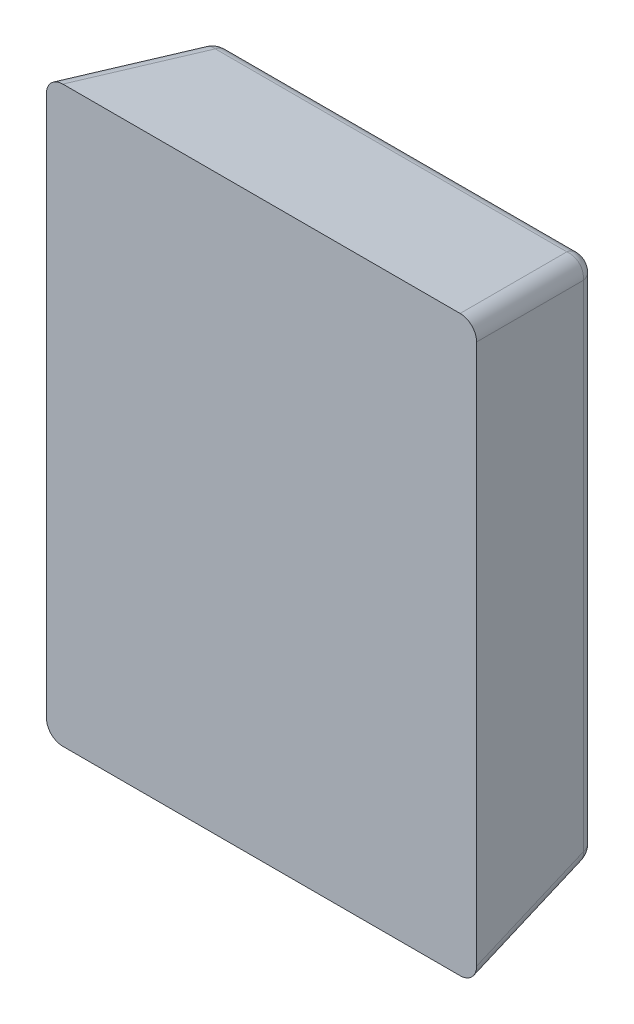
ISO-10303-21;
HEADER;
FILE_DESCRIPTION(('STEP AP214'),'2;1');
FILE_NAME('part.step','',(''),(''),'','','');
FILE_SCHEMA(('AUTOMOTIVE_DESIGN { 1 0 10303 214 1 1 1 1 }'));
ENDSEC;
DATA;
#1=APPLICATION_CONTEXT('core data for automotive mechanical design processes');
#2=APPLICATION_PROTOCOL_DEFINITION('international standard','automotive_design',2000,#1);
#3=PRODUCT_CONTEXT('',#1,'mechanical');
#4=PRODUCT('Part','Part','',(#3));
#5=PRODUCT_RELATED_PRODUCT_CATEGORY('part','',(#4));
#6=PRODUCT_DEFINITION_FORMATION('','',#4);
#7=PRODUCT_DEFINITION_CONTEXT('part definition',#1,'design');
#8=PRODUCT_DEFINITION('design','',#6,#7);
#9=PRODUCT_DEFINITION_SHAPE('','',#8);
#10=(LENGTH_UNIT() NAMED_UNIT(*) SI_UNIT(.MILLI.,.METRE.));
#11=(NAMED_UNIT(*) PLANE_ANGLE_UNIT() SI_UNIT($,.RADIAN.));
#12=(NAMED_UNIT(*) SI_UNIT($,.STERADIAN.) SOLID_ANGLE_UNIT());
#13=UNCERTAINTY_MEASURE_WITH_UNIT(LENGTH_MEASURE(1.E-05),#10,'distance_accuracy_value','');
#14=(GEOMETRIC_REPRESENTATION_CONTEXT(3) GLOBAL_UNCERTAINTY_ASSIGNED_CONTEXT((#13)) GLOBAL_UNIT_ASSIGNED_CONTEXT((#10,
#11,#12)) REPRESENTATION_CONTEXT('',''));
#15=CARTESIAN_POINT('',(0.,0.,0.));
#16=DIRECTION('',(0.,0.,1.));
#17=DIRECTION('',(1.,0.,0.));
#18=AXIS2_PLACEMENT_3D('',#15,#16,#17);
#19=CARTESIAN_POINT('',(-0.927464285309384,-0.641019643054923,0.105));
#20=DIRECTION('',(0.,0.,-1.));
#21=DIRECTION('',(-1.,0.,0.));
#22=AXIS2_PLACEMENT_3D('',#19,#20,#21);
#23=PLANE('',#22);
#24=DIRECTION('',(0.,-1.,0.));
#25=VECTOR('',#24,1.);
#26=CARTESIAN_POINT('',(-0.853917601570132,-0.701017157850477,0.105));
#27=LINE('',#26,#25);
#28=CARTESIAN_POINT('',(-0.853917601570131,-0.744561356385283,0.105));
#29=VERTEX_POINT('',#28);
#30=CARTESIAN_POINT('',(-0.853917601570132,-0.537477929724562,0.105));
#31=VERTEX_POINT('',#30);
#32=EDGE_CURVE('E236',#29,#31,#27,.F.);
#33=ORIENTED_EDGE('',*,*,#32,.F.);
#34=DIRECTION('',(-1.,0.,0.));
#35=VECTOR('',#34,1.);
#36=CARTESIAN_POINT('',(-0.972464285309384,-0.744561356385283,0.105));
#37=LINE('',#36,#35);
#38=CARTESIAN_POINT('',(-1.00101096904863,-0.744561356385283,0.105));
#39=VERTEX_POINT('',#38);
#40=EDGE_CURVE('E224',#39,#29,#37,.F.);
#41=ORIENTED_EDGE('',*,*,#40,.F.);
#42=DIRECTION('',(0.,1.,0.));
#43=VECTOR('',#42,1.);
#44=CARTESIAN_POINT('',(-1.00101096904864,-0.581022128259368,0.105));
#45=LINE('',#44,#43);
#46=CARTESIAN_POINT('',(-1.00101096904864,-0.537477929724562,0.105));
#47=VERTEX_POINT('',#46);
#48=EDGE_CURVE('E229',#47,#39,#45,.F.);
#49=ORIENTED_EDGE('',*,*,#48,.F.);
#50=DIRECTION('',(1.,0.,0.));
#51=VECTOR('',#50,1.);
#52=CARTESIAN_POINT('',(-0.882464285309384,-0.537477929724562,0.105));
#53=LINE('',#52,#51);
#54=EDGE_CURVE('E241',#31,#47,#53,.F.);
#55=ORIENTED_EDGE('',*,*,#54,.F.);
#56=EDGE_LOOP('',(#33,#41,#49,#55));
#57=FACE_BOUND('',#56,.T.);
#58=ADVANCED_FACE('F17',(#57),#23,.T.);
#59=CARTESIAN_POINT('',(-1.00101096904864,-0.581022128259368,0.112));
#60=DIRECTION('',(0.,1.,0.));
#61=DIRECTION('',(-1.,0.,0.));
#62=AXIS2_PLACEMENT_3D('',#59,#60,#61);
#63=CYLINDRICAL_SURFACE('',#62,0.007);
#64=DIRECTION('',(0.,1.,0.));
#65=VECTOR('',#64,1.);
#66=CARTESIAN_POINT('',(-1.00790462331972,-0.521024613463813,0.110784462756332));
#67=LINE('',#66,#65);
#68=CARTESIAN_POINT('',(-1.00790462331972,-0.537477929724562,0.110784462756332));
#69=VERTEX_POINT('',#68);
#70=CARTESIAN_POINT('',(-1.00790462331972,-0.744561356385283,0.110784462756331));
#71=VERTEX_POINT('',#70);
#72=EDGE_CURVE('E114',#69,#71,#67,.F.);
#73=ORIENTED_EDGE('',*,*,#72,.F.);
#74=CARTESIAN_POINT('',(-1.00101096904863,-0.537477929724562,0.112));
#75=DIRECTION('',(0.,1.,0.));
#76=DIRECTION('',(1.,0.,0.));
#77=AXIS2_PLACEMENT_3D('',#74,#75,#76);
#78=CIRCLE('',#77,0.007);
#79=EDGE_CURVE('E221',#47,#69,#78,.T.);
#80=ORIENTED_EDGE('',*,*,#79,.F.);
#81=ORIENTED_EDGE('',*,*,#48,.T.);
#82=CARTESIAN_POINT('',(-1.00101096904863,-0.744561356385283,0.112));
#83=DIRECTION('',(0.,1.,0.));
#84=DIRECTION('',(1.,0.,0.));
#85=AXIS2_PLACEMENT_3D('',#82,#83,#84);
#86=CIRCLE('',#85,0.007);
#87=EDGE_CURVE('E74',#71,#39,#86,.F.);
#88=ORIENTED_EDGE('',*,*,#87,.F.);
#89=EDGE_LOOP('',(#73,#80,#81,#88));
#90=FACE_BOUND('',#89,.T.);
#91=ADVANCED_FACE('F214',(#90),#63,.T.);
#92=CARTESIAN_POINT('',(-1.00101096904863,-0.537477929724562,0.112));
#93=DIRECTION('',(1.,0.,0.));
#94=DIRECTION('',(0.,1.,0.));
#95=AXIS2_PLACEMENT_3D('',#92,#93,#94);
#96=SPHERICAL_SURFACE('',#95,0.007);
#97=ORIENTED_EDGE('',*,*,#79,.T.);
#98=CARTESIAN_POINT('',(-1.00101096904863,-0.537477929724562,0.111999999999999));
#99=DIRECTION('',(-0.17108786974604,0.171087869746041,0.970287525247812));
#100=DIRECTION('',(0.,-0.984807753012207,0.173648177666936));
#101=AXIS2_PLACEMENT_3D('',#98,#99,#100);
#102=CIRCLE('',#101,0.007);
#103=CARTESIAN_POINT('',(-1.00101096904864,-0.530584275453477,0.11078446275633));
#104=VERTEX_POINT('',#103);
#105=EDGE_CURVE('E20',#104,#69,#102,.T.);
#106=ORIENTED_EDGE('',*,*,#105,.F.);
#107=CARTESIAN_POINT('',(-1.00101096904864,-0.537477929724562,0.112));
#108=DIRECTION('',(1.,0.,0.));
#109=DIRECTION('',(0.,1.,0.));
#110=AXIS2_PLACEMENT_3D('',#107,#108,#109);
#111=CIRCLE('',#110,0.007);
#112=EDGE_CURVE('E223',#47,#104,#111,.T.);
#113=ORIENTED_EDGE('',*,*,#112,.F.);
#114=EDGE_LOOP('',(#97,#106,#113));
#115=FACE_BOUND('',#114,.T.);
#116=ADVANCED_FACE('F210',(#115),#96,.T.);
#117=CARTESIAN_POINT('',(-0.882464285309384,-0.537477929724562,0.112));
#118=DIRECTION('',(1.,0.,0.));
#119=DIRECTION('',(0.,1.,0.));
#120=AXIS2_PLACEMENT_3D('',#117,#118,#119);
#121=CYLINDRICAL_SURFACE('',#120,0.007);
#122=DIRECTION('',(1.,0.,0.));
#123=VECTOR('',#122,1.);
#124=CARTESIAN_POINT('',(-0.837464285309383,-0.530584275453476,0.110784462756331));
#125=LINE('',#124,#123);
#126=CARTESIAN_POINT('',(-0.853917601570132,-0.530584275453476,0.110784462756331));
#127=VERTEX_POINT('',#126);
#128=EDGE_CURVE('E146',#127,#104,#125,.F.);
#129=ORIENTED_EDGE('',*,*,#128,.F.);
#130=CARTESIAN_POINT('',(-0.853917601570132,-0.537477929724562,0.112));
#131=DIRECTION('',(1.,0.,0.));
#132=DIRECTION('',(0.,1.,0.));
#133=AXIS2_PLACEMENT_3D('',#130,#131,#132);
#134=CIRCLE('',#133,0.00699999999999995);
#135=EDGE_CURVE('E198',#31,#127,#134,.T.);
#136=ORIENTED_EDGE('',*,*,#135,.F.);
#137=ORIENTED_EDGE('',*,*,#54,.T.);
#138=ORIENTED_EDGE('',*,*,#112,.T.);
#139=EDGE_LOOP('',(#129,#136,#137,#138));
#140=FACE_BOUND('',#139,.T.);
#141=ADVANCED_FACE('F206',(#140),#121,.T.);
#142=CARTESIAN_POINT('',(-0.853917601570132,-0.537477929724562,0.112));
#143=DIRECTION('',(1.,0.,0.));
#144=DIRECTION('',(0.,1.,0.));
#145=AXIS2_PLACEMENT_3D('',#142,#143,#144);
#146=SPHERICAL_SURFACE('',#145,0.007);
#147=ORIENTED_EDGE('',*,*,#135,.T.);
#148=CARTESIAN_POINT('',(-0.853917601570132,-0.537477929724561,0.111999999999999));
#149=DIRECTION('',(0.171087869746028,0.171087869746031,0.970287525247816));
#150=DIRECTION('',(0.,-0.984807753012209,0.173648177666926));
#151=AXIS2_PLACEMENT_3D('',#148,#149,#150);
#152=CIRCLE('',#151,0.007);
#153=CARTESIAN_POINT('',(-0.847023947299047,-0.537477929724563,0.110784462756331));
#154=VERTEX_POINT('',#153);
#155=EDGE_CURVE('E136',#154,#127,#152,.T.);
#156=ORIENTED_EDGE('',*,*,#155,.F.);
#157=CARTESIAN_POINT('',(-0.853917601570132,-0.537477929724562,0.112));
#158=DIRECTION('',(0.,-1.,0.));
#159=DIRECTION('',(1.,0.,0.));
#160=AXIS2_PLACEMENT_3D('',#157,#158,#159);
#161=CIRCLE('',#160,0.007);
#162=EDGE_CURVE('E194',#31,#154,#161,.T.);
#163=ORIENTED_EDGE('',*,*,#162,.F.);
#164=EDGE_LOOP('',(#147,#156,#163));
#165=FACE_BOUND('',#164,.T.);
#166=ADVANCED_FACE('F203',(#165),#146,.T.);
#167=CARTESIAN_POINT('',(-0.853917601570132,-0.701017157850477,0.112));
#168=DIRECTION('',(0.,-1.,0.));
#169=DIRECTION('',(1.,0.,0.));
#170=AXIS2_PLACEMENT_3D('',#167,#168,#169);
#171=CYLINDRICAL_SURFACE('',#170,0.007);
#172=DIRECTION('',(0.,1.,0.));
#173=VECTOR('',#172,1.);
#174=CARTESIAN_POINT('',(-0.847023947299046,-0.761014672646032,0.110784462756331));
#175=LINE('',#174,#173);
#176=CARTESIAN_POINT('',(-0.847023947299046,-0.744561356385283,0.110784462756331));
#177=VERTEX_POINT('',#176);
#178=EDGE_CURVE('E137',#177,#154,#175,.T.);
#179=ORIENTED_EDGE('',*,*,#178,.F.);
#180=CARTESIAN_POINT('',(-0.853917601570131,-0.744561356385283,0.112));
#181=DIRECTION('',(0.,1.,0.));
#182=DIRECTION('',(1.,0.,0.));
#183=AXIS2_PLACEMENT_3D('',#180,#181,#182);
#184=CIRCLE('',#183,0.007);
#185=EDGE_CURVE('E190',#29,#177,#184,.F.);
#186=ORIENTED_EDGE('',*,*,#185,.F.);
#187=ORIENTED_EDGE('',*,*,#32,.T.);
#188=ORIENTED_EDGE('',*,*,#162,.T.);
#189=EDGE_LOOP('',(#179,#186,#187,#188));
#190=FACE_BOUND('',#189,.T.);
#191=ADVANCED_FACE('F182',(#190),#171,.T.);
#192=CARTESIAN_POINT('',(-0.853917601570131,-0.744561356385283,0.112));
#193=DIRECTION('',(1.,0.,0.));
#194=DIRECTION('',(0.,1.,0.));
#195=AXIS2_PLACEMENT_3D('',#192,#193,#194);
#196=SPHERICAL_SURFACE('',#195,0.007);
#197=CARTESIAN_POINT('',(-0.853917601570131,-0.744561356385283,0.112));
#198=DIRECTION('',(-1.,0.,0.));
#199=DIRECTION('',(0.,-1.,0.));
#200=AXIS2_PLACEMENT_3D('',#197,#198,#199);
#201=CIRCLE('',#200,0.007);
#202=CARTESIAN_POINT('',(-0.853917601570131,-0.751455010656368,0.110784462756331));
#203=VERTEX_POINT('',#202);
#204=EDGE_CURVE('E193',#29,#203,#201,.T.);
#205=ORIENTED_EDGE('',*,*,#204,.F.);
#206=ORIENTED_EDGE('',*,*,#185,.T.);
#207=CARTESIAN_POINT('',(-0.853917601570132,-0.744561356385283,0.112));
#208=DIRECTION('',(0.171087869746032,-0.171087869746034,0.970287525247815));
#209=DIRECTION('',(0.,-0.984807753012208,-0.173648177666929));
#210=AXIS2_PLACEMENT_3D('',#207,#208,#209);
#211=CIRCLE('',#210,0.007);
#212=EDGE_CURVE('E133',#203,#177,#211,.T.);
#213=ORIENTED_EDGE('',*,*,#212,.F.);
#214=EDGE_LOOP('',(#205,#206,#213));
#215=FACE_BOUND('',#214,.T.);
#216=ADVANCED_FACE('F178',(#215),#196,.T.);
#217=CARTESIAN_POINT('',(-0.972464285309384,-0.744561356385283,0.112));
#218=DIRECTION('',(-1.,0.,0.));
#219=DIRECTION('',(0.,-1.,0.));
#220=AXIS2_PLACEMENT_3D('',#217,#218,#219);
#221=CYLINDRICAL_SURFACE('',#220,0.007);
#222=DIRECTION('',(1.,0.,0.));
#223=VECTOR('',#222,1.);
#224=CARTESIAN_POINT('',(-1.01746428530938,-0.751455010656368,0.110784462756331));
#225=LINE('',#224,#223);
#226=CARTESIAN_POINT('',(-1.00101096904863,-0.751455010656369,0.110784462756331));
#227=VERTEX_POINT('',#226);
#228=EDGE_CURVE('E134',#227,#203,#225,.T.);
#229=ORIENTED_EDGE('',*,*,#228,.F.);
#230=CARTESIAN_POINT('',(-1.00101096904863,-0.744561356385283,0.112));
#231=DIRECTION('',(1.,0.,0.));
#232=DIRECTION('',(0.,1.,0.));
#233=AXIS2_PLACEMENT_3D('',#230,#231,#232);
#234=CIRCLE('',#233,0.00699999999999995);
#235=EDGE_CURVE('E82',#39,#227,#234,.F.);
#236=ORIENTED_EDGE('',*,*,#235,.F.);
#237=ORIENTED_EDGE('',*,*,#40,.T.);
#238=ORIENTED_EDGE('',*,*,#204,.T.);
#239=EDGE_LOOP('',(#229,#236,#237,#238));
#240=FACE_BOUND('',#239,.T.);
#241=ADVANCED_FACE('F173',(#240),#221,.T.);
#242=CARTESIAN_POINT('',(-1.00101096904863,-0.744561356385283,0.112));
#243=DIRECTION('',(1.,0.,0.));
#244=DIRECTION('',(0.,1.,0.));
#245=AXIS2_PLACEMENT_3D('',#242,#243,#244);
#246=SPHERICAL_SURFACE('',#245,0.007);
#247=ORIENTED_EDGE('',*,*,#87,.T.);
#248=ORIENTED_EDGE('',*,*,#235,.T.);
#249=CARTESIAN_POINT('',(-1.00101096904864,-0.744561356385283,0.111999999999999));
#250=DIRECTION('',(-0.171087869746039,-0.171087869746042,0.970287525247812));
#251=DIRECTION('',(0.,-0.984807753012207,-0.173648177666937));
#252=AXIS2_PLACEMENT_3D('',#249,#250,#251);
#253=CIRCLE('',#252,0.007);
#254=EDGE_CURVE('E126',#71,#227,#253,.T.);
#255=ORIENTED_EDGE('',*,*,#254,.F.);
#256=EDGE_LOOP('',(#247,#248,#255));
#257=FACE_BOUND('',#256,.T.);
#258=ADVANCED_FACE('F169',(#257),#246,.T.);
#259=CARTESIAN_POINT('',(-1.01746428530938,-0.521024613463813,0.165));
#260=DIRECTION('',(-0.984807753012208,0.,-0.173648177666929));
#261=DIRECTION('',(-0.173648177666929,0.,0.984807753012208));
#262=AXIS2_PLACEMENT_3D('',#259,#260,#261);
#263=PLANE('',#262);
#264=DIRECTION('',(-0.17108786974604,0.171087869746041,0.970287525247812));
#265=VECTOR('',#264,1.);
#266=CARTESIAN_POINT('',(-1.0150316745458,-0.530350878498484,0.15120397880227));
#267=LINE('',#266,#265);
#268=CARTESIAN_POINT('',(-1.01746428530938,-0.527918267734898,0.165));
#269=VERTEX_POINT('',#268);
#270=EDGE_CURVE('E104',#69,#269,#267,.T.);
#271=ORIENTED_EDGE('',*,*,#270,.F.);
#272=ORIENTED_EDGE('',*,*,#72,.T.);
#273=DIRECTION('',(-0.171087869746034,-0.171087869746047,0.970287525247812));
#274=VECTOR('',#273,1.);
#275=CARTESIAN_POINT('',(-1.00790462331972,-0.744561356385283,0.110784462756332));
#276=LINE('',#275,#274);
#277=CARTESIAN_POINT('',(-1.01746428530938,-0.754121018374947,0.165));
#278=VERTEX_POINT('',#277);
#279=EDGE_CURVE('E111',#71,#278,#276,.T.);
#280=ORIENTED_EDGE('',*,*,#279,.T.);
#281=DIRECTION('',(0.,1.,0.));
#282=VECTOR('',#281,1.);
#283=CARTESIAN_POINT('',(-1.01746428530938,-0.641019643054923,0.165));
#284=LINE('',#283,#282);
#285=EDGE_CURVE('E113',#278,#269,#284,.T.);
#286=ORIENTED_EDGE('',*,*,#285,.T.);
#287=EDGE_LOOP('',(#271,#272,#280,#286));
#288=FACE_BOUND('',#287,.T.);
#289=ADVANCED_FACE('F112',(#288),#263,.T.);
#290=CARTESIAN_POINT('',(-1.00813802027471,-0.530350878498484,0.152419516045939));
#291=DIRECTION('',(-0.17108786974604,0.171087869746041,0.970287525247812));
#292=DIRECTION('',(0.,-0.984807753012207,0.173648177666936));
#293=AXIS2_PLACEMENT_3D('',#290,#291,#292);
#294=CYLINDRICAL_SURFACE('',#293,0.007);
#295=DIRECTION('',(-0.171087869746149,0.171087869746032,0.970287525247794));
#296=VECTOR('',#295,1.);
#297=CARTESIAN_POINT('',(-1.00101096904863,-0.530584275453477,0.110784462756331));
#298=LINE('',#297,#296);
#299=CARTESIAN_POINT('',(-1.0105706310383,-0.521024613463813,0.165));
#300=VERTEX_POINT('',#299);
#301=EDGE_CURVE('E151',#104,#300,#298,.T.);
#302=ORIENTED_EDGE('',*,*,#301,.F.);
#303=ORIENTED_EDGE('',*,*,#105,.T.);
#304=ORIENTED_EDGE('',*,*,#270,.T.);
#305=CARTESIAN_POINT('',(-1.01035629902618,-0.528132599747013,0.165));
#306=DIRECTION('',(0.,0.,-1.));
#307=DIRECTION('',(-0.707106781186545,0.707106781186551,0.));
#308=AXIS2_PLACEMENT_3D('',#305,#306,#307);
#309=ELLIPSE('',#308,0.00721435638184897,0.007);
#310=EDGE_CURVE('E120',#269,#300,#309,.T.);
#311=ORIENTED_EDGE('',*,*,#310,.T.);
#312=EDGE_LOOP('',(#302,#303,#304,#311));
#313=FACE_BOUND('',#312,.T.);
#314=ADVANCED_FACE('F279',(#313),#294,.T.);
#315=CARTESIAN_POINT('',(-0.837464285309383,-0.521024613463813,0.165));
#316=DIRECTION('',(0.,0.984807753012208,-0.17364817766693));
#317=DIRECTION('',(0.,0.17364817766693,0.984807753012208));
#318=AXIS2_PLACEMENT_3D('',#315,#316,#317);
#319=PLANE('',#318);
#320=DIRECTION('',(0.171087869746028,0.171087869746031,0.970287525247816));
#321=VECTOR('',#320,1.);
#322=CARTESIAN_POINT('',(-0.847668536630149,-0.524335210513493,0.14622467114007));
#323=LINE('',#322,#321);
#324=CARTESIAN_POINT('',(-0.844357939580469,-0.521024613463813,0.165));
#325=VERTEX_POINT('',#324);
#326=EDGE_CURVE('E138',#127,#325,#323,.T.);
#327=ORIENTED_EDGE('',*,*,#326,.F.);
#328=ORIENTED_EDGE('',*,*,#128,.T.);
#329=ORIENTED_EDGE('',*,*,#301,.T.);
#330=DIRECTION('',(-1.,0.,0.));
#331=VECTOR('',#330,1.);
#332=CARTESIAN_POINT('',(-0.927464285309384,-0.521024613463813,0.165));
#333=LINE('',#332,#331);
#334=EDGE_CURVE('E156',#300,#325,#333,.F.);
#335=ORIENTED_EDGE('',*,*,#334,.T.);
#336=EDGE_LOOP('',(#327,#328,#329,#335));
#337=FACE_BOUND('',#336,.T.);
#338=ADVANCED_FACE('F271',(#337),#319,.T.);
#339=CARTESIAN_POINT('',(-0.847668536630149,-0.531228864784578,0.147440208383739));
#340=DIRECTION('',(0.171087869746028,0.171087869746031,0.970287525247816));
#341=DIRECTION('',(0.,-0.984807753012209,0.173648177666926));
#342=AXIS2_PLACEMENT_3D('',#339,#340,#341);
#343=CYLINDRICAL_SURFACE('',#342,0.007);
#344=DIRECTION('',(0.171087869746034,0.171087869746043,0.970287525247813));
#345=VECTOR('',#344,1.);
#346=CARTESIAN_POINT('',(-0.847023947299047,-0.537477929724562,0.110784462756331));
#347=LINE('',#346,#345);
#348=CARTESIAN_POINT('',(-0.837464285309384,-0.527918267734898,0.165));
#349=VERTEX_POINT('',#348);
#350=EDGE_CURVE('E144',#154,#349,#347,.T.);
#351=ORIENTED_EDGE('',*,*,#350,.F.);
#352=ORIENTED_EDGE('',*,*,#155,.T.);
#353=ORIENTED_EDGE('',*,*,#326,.T.);
#354=CARTESIAN_POINT('',(-0.844572271592584,-0.528132599747013,0.165));
#355=DIRECTION('',(0.,0.,-1.));
#356=DIRECTION('',(0.707106781186542,0.707106781186553,0.));
#357=AXIS2_PLACEMENT_3D('',#354,#355,#356);
#358=ELLIPSE('',#357,0.00721435638184894,0.007);
#359=EDGE_CURVE('E159',#325,#349,#358,.T.);
#360=ORIENTED_EDGE('',*,*,#359,.T.);
#361=EDGE_LOOP('',(#351,#352,#353,#360));
#362=FACE_BOUND('',#361,.T.);
#363=ADVANCED_FACE('F269',(#362),#343,.T.);
#364=CARTESIAN_POINT('',(-0.837464285309383,-0.761014672646032,0.165));
#365=DIRECTION('',(0.984807753012208,0.,-0.173648177666928));
#366=DIRECTION('',(-0.173648177666928,0.,-0.984807753012208));
#367=AXIS2_PLACEMENT_3D('',#364,#365,#366);
#368=PLANE('',#367);
#369=ORIENTED_EDGE('',*,*,#350,.T.);
#370=DIRECTION('',(0.,1.,0.));
#371=VECTOR('',#370,1.);
#372=CARTESIAN_POINT('',(-0.837464285309383,-0.641019643054923,0.165));
#373=LINE('',#372,#371);
#374=CARTESIAN_POINT('',(-0.837464285309383,-0.754121018374946,0.165));
#375=VERTEX_POINT('',#374);
#376=EDGE_CURVE('E248',#349,#375,#373,.F.);
#377=ORIENTED_EDGE('',*,*,#376,.T.);
#378=DIRECTION('',(0.171087869746032,-0.171087869746034,0.970287525247815));
#379=VECTOR('',#378,1.);
#380=CARTESIAN_POINT('',(-0.839896896072969,-0.751688407611361,0.151203978802271));
#381=LINE('',#380,#379);
#382=EDGE_CURVE('E135',#177,#375,#381,.T.);
#383=ORIENTED_EDGE('',*,*,#382,.F.);
#384=ORIENTED_EDGE('',*,*,#178,.T.);
#385=EDGE_LOOP('',(#369,#377,#383,#384));
#386=FACE_BOUND('',#385,.T.);
#387=ADVANCED_FACE('F264',(#386),#368,.T.);
#388=CARTESIAN_POINT('',(-0.846790550344054,-0.751688407611361,0.152419516045939));
#389=DIRECTION('',(0.171087869746032,-0.171087869746034,0.970287525247815));
#390=DIRECTION('',(0.,-0.984807753012208,-0.173648177666929));
#391=AXIS2_PLACEMENT_3D('',#388,#389,#390);
#392=CYLINDRICAL_SURFACE('',#391,0.007);
#393=DIRECTION('',(0.171087869746029,-0.171087869746037,0.970287525247815));
#394=VECTOR('',#393,1.);
#395=CARTESIAN_POINT('',(-0.853917601570131,-0.751455010656368,0.110784462756331));
#396=LINE('',#395,#394);
#397=CARTESIAN_POINT('',(-0.844357939580468,-0.761014672646032,0.165));
#398=VERTEX_POINT('',#397);
#399=EDGE_CURVE('E132',#203,#398,#396,.T.);
#400=ORIENTED_EDGE('',*,*,#399,.F.);
#401=ORIENTED_EDGE('',*,*,#212,.T.);
#402=ORIENTED_EDGE('',*,*,#382,.T.);
#403=CARTESIAN_POINT('',(-0.844572271592583,-0.753906686362832,0.165));
#404=DIRECTION('',(0.,0.,-1.));
#405=DIRECTION('',(0.707106781186544,-0.707106781186551,0.));
#406=AXIS2_PLACEMENT_3D('',#403,#404,#405);
#407=ELLIPSE('',#406,0.00721435638184896,0.007);
#408=EDGE_CURVE('E26',#375,#398,#407,.T.);
#409=ORIENTED_EDGE('',*,*,#408,.T.);
#410=EDGE_LOOP('',(#400,#401,#402,#409));
#411=FACE_BOUND('',#410,.T.);
#412=ADVANCED_FACE('F263',(#411),#392,.T.);
#413=CARTESIAN_POINT('',(-1.01746428530938,-0.761014672646032,0.165));
#414=DIRECTION('',(0.,-0.984807753012208,-0.173648177666931));
#415=DIRECTION('',(0.,0.173648177666931,-0.984807753012208));
#416=AXIS2_PLACEMENT_3D('',#413,#414,#415);
#417=PLANE('',#416);
#418=ORIENTED_EDGE('',*,*,#399,.T.);
#419=DIRECTION('',(-1.,0.,0.));
#420=VECTOR('',#419,1.);
#421=CARTESIAN_POINT('',(-0.927464285309384,-0.761014672646032,0.165));
#422=LINE('',#421,#420);
#423=CARTESIAN_POINT('',(-1.0105706310383,-0.761014672646032,0.165));
#424=VERTEX_POINT('',#423);
#425=EDGE_CURVE('E11',#398,#424,#422,.T.);
#426=ORIENTED_EDGE('',*,*,#425,.T.);
#427=DIRECTION('',(-0.171087869746041,-0.171087869746037,0.970287525247813));
#428=VECTOR('',#427,1.);
#429=CARTESIAN_POINT('',(-1.00101096904864,-0.751455010656368,0.11078446275633));
#430=LINE('',#429,#428);
#431=EDGE_CURVE('E124',#227,#424,#430,.T.);
#432=ORIENTED_EDGE('',*,*,#431,.F.);
#433=ORIENTED_EDGE('',*,*,#228,.T.);
#434=EDGE_LOOP('',(#418,#426,#432,#433));
#435=FACE_BOUND('',#434,.T.);
#436=ADVANCED_FACE('F259',(#435),#417,.T.);
#437=CARTESIAN_POINT('',(-1.00726003398862,-0.750810421325267,0.147440208383738));
#438=DIRECTION('',(-0.171087869746039,-0.171087869746042,0.970287525247812));
#439=DIRECTION('',(0.,-0.984807753012207,-0.173648177666937));
#440=AXIS2_PLACEMENT_3D('',#437,#438,#439);
#441=CYLINDRICAL_SURFACE('',#440,0.007);
#442=ORIENTED_EDGE('',*,*,#431,.T.);
#443=CARTESIAN_POINT('',(-1.01035629902619,-0.753906686362832,0.165));
#444=DIRECTION('',(0.,0.,-1.));
#445=DIRECTION('',(-0.70710678118654,-0.707106781186555,0.));
#446=AXIS2_PLACEMENT_3D('',#443,#444,#445);
#447=ELLIPSE('',#446,0.00721435638184897,0.007);
#448=EDGE_CURVE('E35',#424,#278,#447,.T.);
#449=ORIENTED_EDGE('',*,*,#448,.T.);
#450=ORIENTED_EDGE('',*,*,#279,.F.);
#451=ORIENTED_EDGE('',*,*,#254,.T.);
#452=EDGE_LOOP('',(#442,#449,#450,#451));
#453=FACE_BOUND('',#452,.T.);
#454=ADVANCED_FACE('F122',(#453),#441,.T.);
#455=CARTESIAN_POINT('',(-0.927464285309384,-0.641019643054923,0.165));
#456=DIRECTION('',(0.,0.,-1.));
#457=DIRECTION('',(-1.,0.,0.));
#458=AXIS2_PLACEMENT_3D('',#455,#456,#457);
#459=PLANE('',#458);
#460=ORIENTED_EDGE('',*,*,#425,.F.);
#461=ORIENTED_EDGE('',*,*,#408,.F.);
#462=ORIENTED_EDGE('',*,*,#376,.F.);
#463=ORIENTED_EDGE('',*,*,#359,.F.);
#464=ORIENTED_EDGE('',*,*,#334,.F.);
#465=ORIENTED_EDGE('',*,*,#310,.F.);
#466=ORIENTED_EDGE('',*,*,#285,.F.);
#467=ORIENTED_EDGE('',*,*,#448,.F.);
#468=EDGE_LOOP('',(#460,#461,#462,#463,#464,#465,#466,#467));
#469=FACE_BOUND('',#468,.T.);
#470=ADVANCED_FACE('F118',(#469),#459,.F.);
#471=CLOSED_SHELL('',(#58,#91,#116,#141,#166,#191,#216,#241,#258,#289,#314,#338,#363,#387,#412,
#436,#454,#470));
#472=MANIFOLD_SOLID_BREP('B1',#471);
#473=ADVANCED_BREP_SHAPE_REPRESENTATION('',(#18,#472),#14);
#474=SHAPE_DEFINITION_REPRESENTATION(#9,#473);
ENDSEC;
END-ISO-10303-21;
